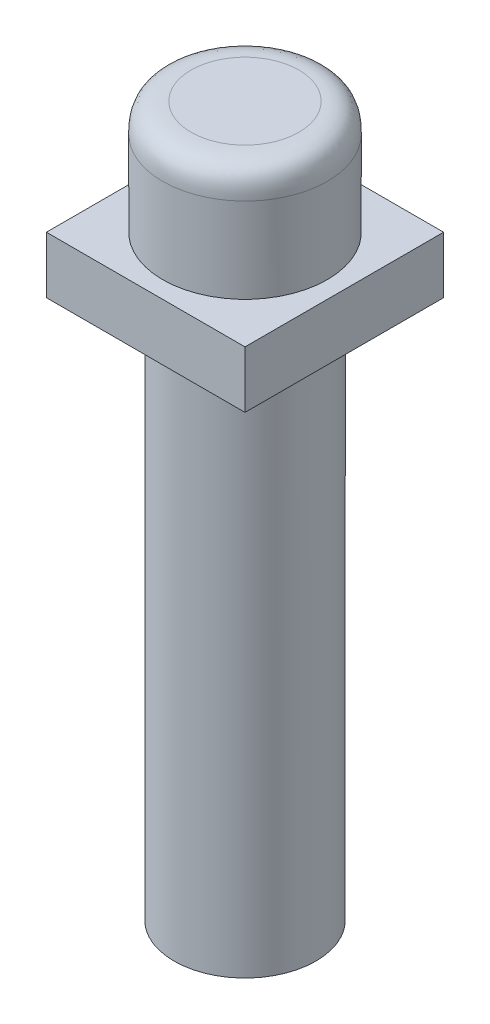
ISO-10303-21;
HEADER;
FILE_DESCRIPTION(('STEP AP214'),'2;1');
FILE_NAME('part.step','',(''),(''),'','','');
FILE_SCHEMA(('AUTOMOTIVE_DESIGN { 1 0 10303 214 1 1 1 1 }'));
ENDSEC;
DATA;
#1=APPLICATION_CONTEXT('core data for automotive mechanical design processes');
#2=APPLICATION_PROTOCOL_DEFINITION('international standard','automotive_design',2000,#1);
#3=PRODUCT_CONTEXT('',#1,'mechanical');
#4=PRODUCT('Part','Part','',(#3));
#5=PRODUCT_RELATED_PRODUCT_CATEGORY('part','',(#4));
#6=PRODUCT_DEFINITION_FORMATION('','',#4);
#7=PRODUCT_DEFINITION_CONTEXT('part definition',#1,'design');
#8=PRODUCT_DEFINITION('design','',#6,#7);
#9=PRODUCT_DEFINITION_SHAPE('','',#8);
#10=(LENGTH_UNIT() NAMED_UNIT(*) SI_UNIT(.MILLI.,.METRE.));
#11=(NAMED_UNIT(*) PLANE_ANGLE_UNIT() SI_UNIT($,.RADIAN.));
#12=(NAMED_UNIT(*) SI_UNIT($,.STERADIAN.) SOLID_ANGLE_UNIT());
#13=UNCERTAINTY_MEASURE_WITH_UNIT(LENGTH_MEASURE(1.E-05),#10,'distance_accuracy_value','');
#14=(GEOMETRIC_REPRESENTATION_CONTEXT(3) GLOBAL_UNCERTAINTY_ASSIGNED_CONTEXT((#13)) GLOBAL_UNIT_ASSIGNED_CONTEXT((#10,
#11,#12)) REPRESENTATION_CONTEXT('',''));
#15=CARTESIAN_POINT('',(0.,0.,0.));
#16=DIRECTION('',(0.,0.,1.));
#17=DIRECTION('',(1.,0.,0.));
#18=AXIS2_PLACEMENT_3D('',#15,#16,#17);
#19=CARTESIAN_POINT('',(3.5,2.,-3.5));
#20=DIRECTION('',(-1.,0.,0.));
#21=DIRECTION('',(0.,0.,1.));
#22=AXIS2_PLACEMENT_3D('',#19,#20,#21);
#23=PLANE('',#22);
#24=DIRECTION('',(0.,0.,-1.));
#25=VECTOR('',#24,1.);
#26=CARTESIAN_POINT('',(3.5,0.,-3.5));
#27=LINE('',#26,#25);
#28=CARTESIAN_POINT('',(3.5,0.,3.5));
#29=VERTEX_POINT('',#28);
#30=CARTESIAN_POINT('',(3.5,0.,-3.5));
#31=VERTEX_POINT('',#30);
#32=EDGE_CURVE('E114',#29,#31,#27,.T.);
#33=ORIENTED_EDGE('',*,*,#32,.T.);
#34=DIRECTION('',(0.,-1.,0.));
#35=VECTOR('',#34,1.);
#36=CARTESIAN_POINT('',(3.5,2.,-3.5));
#37=LINE('',#36,#35);
#38=CARTESIAN_POINT('',(3.5,2.,-3.5));
#39=VERTEX_POINT('',#38);
#40=EDGE_CURVE('E105',#39,#31,#37,.T.);
#41=ORIENTED_EDGE('',*,*,#40,.F.);
#42=DIRECTION('',(0.,0.,-1.));
#43=VECTOR('',#42,1.);
#44=CARTESIAN_POINT('',(3.5,2.,-3.5));
#45=LINE('',#44,#43);
#46=CARTESIAN_POINT('',(3.5,2.,3.5));
#47=VERTEX_POINT('',#46);
#48=EDGE_CURVE('E99',#47,#39,#45,.T.);
#49=ORIENTED_EDGE('',*,*,#48,.F.);
#50=DIRECTION('',(0.,-1.,0.));
#51=VECTOR('',#50,1.);
#52=CARTESIAN_POINT('',(3.5,2.,3.5));
#53=LINE('',#52,#51);
#54=EDGE_CURVE('E110',#47,#29,#53,.T.);
#55=ORIENTED_EDGE('',*,*,#54,.T.);
#56=EDGE_LOOP('',(#33,#41,#49,#55));
#57=FACE_BOUND('',#56,.T.);
#58=ADVANCED_FACE('F40',(#57),#23,.F.);
#59=CARTESIAN_POINT('',(-3.5,2.,-3.5));
#60=DIRECTION('',(0.,0.,1.));
#61=DIRECTION('',(1.,0.,0.));
#62=AXIS2_PLACEMENT_3D('',#59,#60,#61);
#63=PLANE('',#62);
#64=DIRECTION('',(-1.,0.,0.));
#65=VECTOR('',#64,1.);
#66=CARTESIAN_POINT('',(-3.5,0.,-3.5));
#67=LINE('',#66,#65);
#68=CARTESIAN_POINT('',(-3.5,0.,-3.5));
#69=VERTEX_POINT('',#68);
#70=EDGE_CURVE('E104',#31,#69,#67,.T.);
#71=ORIENTED_EDGE('',*,*,#70,.T.);
#72=DIRECTION('',(0.,-1.,0.));
#73=VECTOR('',#72,1.);
#74=CARTESIAN_POINT('',(-3.5,2.,-3.5));
#75=LINE('',#74,#73);
#76=CARTESIAN_POINT('',(-3.5,2.,-3.5));
#77=VERTEX_POINT('',#76);
#78=EDGE_CURVE('E102',#77,#69,#75,.T.);
#79=ORIENTED_EDGE('',*,*,#78,.F.);
#80=DIRECTION('',(-1.,0.,0.));
#81=VECTOR('',#80,1.);
#82=CARTESIAN_POINT('',(-3.5,2.,-3.5));
#83=LINE('',#82,#81);
#84=EDGE_CURVE('E94',#39,#77,#83,.T.);
#85=ORIENTED_EDGE('',*,*,#84,.F.);
#86=ORIENTED_EDGE('',*,*,#40,.T.);
#87=EDGE_LOOP('',(#71,#79,#85,#86));
#88=FACE_BOUND('',#87,.T.);
#89=ADVANCED_FACE('F103',(#88),#63,.F.);
#90=CARTESIAN_POINT('',(-3.5,2.,-3.5));
#91=DIRECTION('',(1.,0.,0.));
#92=DIRECTION('',(0.,0.,-1.));
#93=AXIS2_PLACEMENT_3D('',#90,#91,#92);
#94=PLANE('',#93);
#95=DIRECTION('',(0.,0.,1.));
#96=VECTOR('',#95,1.);
#97=CARTESIAN_POINT('',(-3.5,0.,-3.5));
#98=LINE('',#97,#96);
#99=CARTESIAN_POINT('',(-3.5,0.,3.5));
#100=VERTEX_POINT('',#99);
#101=EDGE_CURVE('E80',#69,#100,#98,.T.);
#102=ORIENTED_EDGE('',*,*,#101,.T.);
#103=DIRECTION('',(0.,-1.,0.));
#104=VECTOR('',#103,1.);
#105=CARTESIAN_POINT('',(-3.5,2.,3.5));
#106=LINE('',#105,#104);
#107=CARTESIAN_POINT('',(-3.5,2.,3.5));
#108=VERTEX_POINT('',#107);
#109=EDGE_CURVE('E106',#108,#100,#106,.T.);
#110=ORIENTED_EDGE('',*,*,#109,.F.);
#111=DIRECTION('',(0.,0.,1.));
#112=VECTOR('',#111,1.);
#113=CARTESIAN_POINT('',(-3.5,2.,-3.5));
#114=LINE('',#113,#112);
#115=EDGE_CURVE('E97',#77,#108,#114,.T.);
#116=ORIENTED_EDGE('',*,*,#115,.F.);
#117=ORIENTED_EDGE('',*,*,#78,.T.);
#118=EDGE_LOOP('',(#102,#110,#116,#117));
#119=FACE_BOUND('',#118,.T.);
#120=ADVANCED_FACE('F108',(#119),#94,.F.);
#121=CARTESIAN_POINT('',(-3.5,2.,3.5));
#122=DIRECTION('',(0.,0.,-1.));
#123=DIRECTION('',(-1.,0.,0.));
#124=AXIS2_PLACEMENT_3D('',#121,#122,#123);
#125=PLANE('',#124);
#126=DIRECTION('',(1.,0.,0.));
#127=VECTOR('',#126,1.);
#128=CARTESIAN_POINT('',(-3.5,0.,3.5));
#129=LINE('',#128,#127);
#130=EDGE_CURVE('E86',#100,#29,#129,.T.);
#131=ORIENTED_EDGE('',*,*,#130,.T.);
#132=ORIENTED_EDGE('',*,*,#54,.F.);
#133=DIRECTION('',(1.,0.,0.));
#134=VECTOR('',#133,1.);
#135=CARTESIAN_POINT('',(-3.5,2.,3.5));
#136=LINE('',#135,#134);
#137=EDGE_CURVE('E63',#108,#47,#136,.T.);
#138=ORIENTED_EDGE('',*,*,#137,.F.);
#139=ORIENTED_EDGE('',*,*,#109,.T.);
#140=EDGE_LOOP('',(#131,#132,#138,#139));
#141=FACE_BOUND('',#140,.T.);
#142=ADVANCED_FACE('F210',(#141),#125,.F.);
#143=CARTESIAN_POINT('',(0.,2.,0.));
#144=DIRECTION('',(0.,1.,0.));
#145=DIRECTION('',(0.,0.,1.));
#146=AXIS2_PLACEMENT_3D('',#143,#144,#145);
#147=PLANE('',#146);
#148=CARTESIAN_POINT('',(0.,2.,0.));
#149=DIRECTION('',(0.,1.,0.));
#150=DIRECTION('',(0.,0.,1.));
#151=AXIS2_PLACEMENT_3D('',#148,#149,#150);
#152=CIRCLE('',#151,2.9);
#153=CARTESIAN_POINT('',(0.,2.,2.9));
#154=VERTEX_POINT('',#153);
#155=EDGE_CURVE('E124',#154,#154,#152,.T.);
#156=ORIENTED_EDGE('',*,*,#155,.F.);
#157=EDGE_LOOP('',(#156));
#158=FACE_BOUND('',#157,.T.);
#159=ORIENTED_EDGE('',*,*,#48,.T.);
#160=ORIENTED_EDGE('',*,*,#84,.T.);
#161=ORIENTED_EDGE('',*,*,#115,.T.);
#162=ORIENTED_EDGE('',*,*,#137,.T.);
#163=EDGE_LOOP('',(#159,#160,#161,#162));
#164=FACE_BOUND('',#163,.T.);
#165=ADVANCED_FACE('F95',(#158,#164),#147,.T.);
#166=CARTESIAN_POINT('',(0.,0.,0.));
#167=DIRECTION('',(0.,1.,0.));
#168=DIRECTION('',(0.,0.,1.));
#169=AXIS2_PLACEMENT_3D('',#166,#167,#168);
#170=PLANE('',#169);
#171=CARTESIAN_POINT('',(0.,0.,0.));
#172=DIRECTION('',(0.,1.,0.));
#173=DIRECTION('',(0.,0.,1.));
#174=AXIS2_PLACEMENT_3D('',#171,#172,#173);
#175=CIRCLE('',#174,2.5);
#176=CARTESIAN_POINT('',(0.,0.,2.5));
#177=VERTEX_POINT('',#176);
#178=EDGE_CURVE('E125',#177,#177,#175,.F.);
#179=ORIENTED_EDGE('',*,*,#178,.F.);
#180=EDGE_LOOP('',(#179));
#181=FACE_BOUND('',#180,.T.);
#182=ORIENTED_EDGE('',*,*,#32,.F.);
#183=ORIENTED_EDGE('',*,*,#130,.F.);
#184=ORIENTED_EDGE('',*,*,#101,.F.);
#185=ORIENTED_EDGE('',*,*,#70,.F.);
#186=EDGE_LOOP('',(#182,#183,#184,#185));
#187=FACE_BOUND('',#186,.T.);
#188=ADVANCED_FACE('F154',(#181,#187),#170,.F.);
#189=CARTESIAN_POINT('',(0.,6.,0.));
#190=DIRECTION('',(0.,-1.,0.));
#191=DIRECTION('',(0.,0.,-1.));
#192=AXIS2_PLACEMENT_3D('',#189,#190,#191);
#193=CYLINDRICAL_SURFACE('',#192,2.9);
#194=CARTESIAN_POINT('',(0.,5.,2.9));
#195=CARTESIAN_POINT('',(0.379558029501162,5.,2.9));
#196=CARTESIAN_POINT('',(1.13867408850348,5.00000000000001,2.74900242758793));
#197=CARTESIAN_POINT('',(2.10399536913863,5.,2.10399536913863));
#198=CARTESIAN_POINT('',(2.74900242758793,5.,1.13867408850348));
#199=CARTESIAN_POINT('',(2.97549878620603,5.,0.));
#200=CARTESIAN_POINT('',(2.74900242758793,5.00000000000001,-1.13867408850348));
#201=CARTESIAN_POINT('',(2.10399536913862,5.,-2.10399536913863));
#202=CARTESIAN_POINT('',(1.13867408850349,5.00000000000001,-2.74900242758793));
#203=CARTESIAN_POINT('',(0.,5.,-2.97549878620603));
#204=CARTESIAN_POINT('',(-1.13867408850347,5.00000000000001,-2.74900242758794));
#205=CARTESIAN_POINT('',(-2.10399536913863,5.,-2.10399536913862));
#206=CARTESIAN_POINT('',(-2.74900242758793,5.,-1.13867408850349));
#207=CARTESIAN_POINT('',(-2.97549878620604,5.00000000000001,0.));
#208=CARTESIAN_POINT('',(-2.74900242758793,5.00000000000001,1.13867408850347));
#209=CARTESIAN_POINT('',(-2.10399536913864,5.00000000000001,2.10399536913862));
#210=CARTESIAN_POINT('',(-1.13867408850349,5.00000000000001,2.74900242758793));
#211=CARTESIAN_POINT('',(-0.379558029501162,5.,2.9));
#212=CARTESIAN_POINT('',(0.,5.,2.9));
#213=B_SPLINE_CURVE_WITH_KNOTS('',3,(#194,#195,#196,#197,#198,#199,#200,#201,#202,#203,#204,
#205,#206,#207,#208,#209,#210,#211,#212),.UNSPECIFIED.,.T.,.F.,(4,1,1,1,1,1,1,1,1,1,1,1,1,1,1,1,
4),(0.,0.392699081698724,0.785398163397448,1.17809724509617,1.5707963267949,1.96349540849362,
2.35619449019234,2.74889357189107,3.14159265358979,3.53429173528852,3.92699081698724,
4.31968989868597,4.71238898038469,5.10508806208341,5.49778714378214,5.89048622548086,
6.28318530717959),.UNSPECIFIED.);
#214=CARTESIAN_POINT('',(0.,5.00000000000001,2.9));
#215=VERTEX_POINT('',#214);
#216=EDGE_CURVE('E12',#215,#215,#213,.F.);
#217=ORIENTED_EDGE('',*,*,#216,.T.);
#218=EDGE_LOOP('',(#217));
#219=FACE_BOUND('',#218,.T.);
#220=ORIENTED_EDGE('',*,*,#155,.T.);
#221=EDGE_LOOP('',(#220));
#222=FACE_BOUND('',#221,.T.);
#223=ADVANCED_FACE('F148',(#219,#222),#193,.T.);
#224=CARTESIAN_POINT('',(0.,6.,0.));
#225=DIRECTION('',(0.,1.,0.));
#226=DIRECTION('',(0.,0.,1.));
#227=AXIS2_PLACEMENT_3D('',#224,#225,#226);
#228=PLANE('',#227);
#229=CARTESIAN_POINT('',(0.,6.,1.9));
#230=CARTESIAN_POINT('',(-0.24867595036283,6.,1.9));
#231=CARTESIAN_POINT('',(-0.746027851088491,6.,1.80107055600589));
#232=CARTESIAN_POINT('',(-1.37847972460807,6.,1.37847972460806));
#233=CARTESIAN_POINT('',(-1.80107055600589,6.,0.746027851088483));
#234=CARTESIAN_POINT('',(-1.94946472199706,6.,0.));
#235=CARTESIAN_POINT('',(-1.80107055600588,6.,-0.746027851088495));
#236=CARTESIAN_POINT('',(-1.37847972460807,6.,-1.37847972460806));
#237=CARTESIAN_POINT('',(-0.746027851088484,6.,-1.80107055600589));
#238=CARTESIAN_POINT('',(0.,6.,-1.94946472199706));
#239=CARTESIAN_POINT('',(0.746027851088495,6.,-1.80107055600588));
#240=CARTESIAN_POINT('',(1.37847972460806,6.,-1.37847972460807));
#241=CARTESIAN_POINT('',(1.80107055600589,6.,-0.74602785108849));
#242=CARTESIAN_POINT('',(1.94946472199706,6.,0.));
#243=CARTESIAN_POINT('',(1.80107055600589,6.,0.746027851088488));
#244=CARTESIAN_POINT('',(1.37847972460807,6.,1.37847972460807));
#245=CARTESIAN_POINT('',(0.746027851088489,6.,1.80107055600589));
#246=CARTESIAN_POINT('',(0.24867595036283,6.,1.9));
#247=CARTESIAN_POINT('',(0.,6.,1.9));
#248=B_SPLINE_CURVE_WITH_KNOTS('',3,(#229,#230,#231,#232,#233,#234,#235,#236,#237,#238,#239,
#240,#241,#242,#243,#244,#245,#246,#247),.UNSPECIFIED.,.T.,.F.,(4,1,1,1,1,1,1,1,1,1,1,1,1,1,1,1,
4),(0.,0.392699081698724,0.785398163397448,1.17809724509617,1.5707963267949,1.96349540849362,
2.35619449019235,2.74889357189107,3.14159265358979,3.53429173528852,3.92699081698724,
4.31968989868597,4.71238898038469,5.10508806208341,5.49778714378214,5.89048622548086,
6.28318530717959),.UNSPECIFIED.);
#249=CARTESIAN_POINT('',(0.,6.,1.9));
#250=VERTEX_POINT('',#249);
#251=EDGE_CURVE('E55',#250,#250,#248,.F.);
#252=ORIENTED_EDGE('',*,*,#251,.T.);
#253=EDGE_LOOP('',(#252));
#254=FACE_BOUND('',#253,.T.);
#255=ADVANCED_FACE('F137',(#254),#228,.T.);
#256=CARTESIAN_POINT('',(0.,-19.,0.));
#257=DIRECTION('',(0.,-1.,0.));
#258=DIRECTION('',(0.,0.,-1.));
#259=AXIS2_PLACEMENT_3D('',#256,#257,#258);
#260=PLANE('',#259);
#261=CARTESIAN_POINT('',(0.,-19.,0.));
#262=DIRECTION('',(0.,-1.,0.));
#263=DIRECTION('',(0.,0.,-1.));
#264=AXIS2_PLACEMENT_3D('',#261,#262,#263);
#265=CIRCLE('',#264,2.5);
#266=CARTESIAN_POINT('',(0.,-19.,-2.5));
#267=VERTEX_POINT('',#266);
#268=EDGE_CURVE('E117',#267,#267,#265,.T.);
#269=ORIENTED_EDGE('',*,*,#268,.T.);
#270=EDGE_LOOP('',(#269));
#271=FACE_BOUND('',#270,.T.);
#272=CARTESIAN_POINT('',(0.,-19.,0.));
#273=DIRECTION('',(0.,-1.,0.));
#274=DIRECTION('',(0.,0.,-1.));
#275=AXIS2_PLACEMENT_3D('',#272,#273,#274);
#276=CIRCLE('',#275,1.25);
#277=CARTESIAN_POINT('',(0.,-19.,-1.25));
#278=VERTEX_POINT('',#277);
#279=EDGE_CURVE('E184',#278,#278,#276,.T.);
#280=ORIENTED_EDGE('',*,*,#279,.F.);
#281=EDGE_LOOP('',(#280));
#282=FACE_BOUND('',#281,.T.);
#283=ADVANCED_FACE('F147',(#271,#282),#260,.T.);
#284=CARTESIAN_POINT('',(0.,-19.,0.));
#285=DIRECTION('',(0.,1.,0.));
#286=DIRECTION('',(0.,0.,1.));
#287=AXIS2_PLACEMENT_3D('',#284,#285,#286);
#288=CYLINDRICAL_SURFACE('',#287,2.5);
#289=ORIENTED_EDGE('',*,*,#268,.F.);
#290=EDGE_LOOP('',(#289));
#291=FACE_BOUND('',#290,.T.);
#292=ORIENTED_EDGE('',*,*,#178,.T.);
#293=EDGE_LOOP('',(#292));
#294=FACE_BOUND('',#293,.T.);
#295=ADVANCED_FACE('F149',(#291,#294),#288,.T.);
#296=CARTESIAN_POINT('',(0.,-19.,0.));
#297=DIRECTION('',(0.,1.,0.));
#298=DIRECTION('',(0.,0.,1.));
#299=AXIS2_PLACEMENT_3D('',#296,#297,#298);
#300=CYLINDRICAL_SURFACE('',#299,1.25);
#301=ORIENTED_EDGE('',*,*,#279,.T.);
#302=EDGE_LOOP('',(#301));
#303=FACE_BOUND('',#302,.T.);
#304=CARTESIAN_POINT('',(0.,0.,0.));
#305=DIRECTION('',(0.,-1.,0.));
#306=DIRECTION('',(0.,0.,-1.));
#307=AXIS2_PLACEMENT_3D('',#304,#305,#306);
#308=CIRCLE('',#307,1.25);
#309=CARTESIAN_POINT('',(0.,0.,-1.25));
#310=VERTEX_POINT('',#309);
#311=EDGE_CURVE('E185',#310,#310,#308,.T.);
#312=ORIENTED_EDGE('',*,*,#311,.F.);
#313=EDGE_LOOP('',(#312));
#314=FACE_BOUND('',#313,.T.);
#315=ADVANCED_FACE('F191',(#303,#314),#300,.F.);
#316=ORIENTED_EDGE('',*,*,#311,.T.);
#317=EDGE_LOOP('',(#316));
#318=FACE_BOUND('',#317,.T.);
#319=ADVANCED_FACE('F214',(#318),#170,.F.);
#320=CARTESIAN_POINT('',(0.,6.,1.9));
#321=CARTESIAN_POINT('',(0.24867595036283,6.,1.9));
#322=CARTESIAN_POINT('',(0.746027851088489,6.,1.80107055600589));
#323=CARTESIAN_POINT('',(1.37847972460807,6.,1.37847972460807));
#324=CARTESIAN_POINT('',(1.80107055600589,6.,0.746027851088488));
#325=CARTESIAN_POINT('',(1.94946472199706,6.,0.));
#326=CARTESIAN_POINT('',(1.80107055600589,6.,-0.74602785108849));
#327=CARTESIAN_POINT('',(1.37847972460806,6.,-1.37847972460807));
#328=CARTESIAN_POINT('',(0.746027851088495,6.,-1.80107055600588));
#329=CARTESIAN_POINT('',(0.,6.,-1.94946472199706));
#330=CARTESIAN_POINT('',(-0.746027851088484,6.,-1.80107055600589));
#331=CARTESIAN_POINT('',(-1.37847972460807,6.,-1.37847972460806));
#332=CARTESIAN_POINT('',(-1.80107055600588,6.,-0.746027851088495));
#333=CARTESIAN_POINT('',(-1.94946472199706,6.,0.));
#334=CARTESIAN_POINT('',(-1.80107055600589,6.,0.746027851088483));
#335=CARTESIAN_POINT('',(-1.37847972460807,6.,1.37847972460806));
#336=CARTESIAN_POINT('',(-0.746027851088491,6.,1.80107055600589));
#337=CARTESIAN_POINT('',(-0.24867595036283,6.,1.9));
#338=CARTESIAN_POINT('',(0.,6.,1.9));
#339=CARTESIAN_POINT('',(0.,6.,2.06819805153395));
#340=CARTESIAN_POINT('',(0.270690061054609,6.,2.06819805153395));
#341=CARTESIAN_POINT('',(0.812070183163827,6.,1.96051084979291));
#342=CARTESIAN_POINT('',(1.5005100423755,6.,1.5005100423755));
#343=CARTESIAN_POINT('',(1.96051084979291,6.,0.812070183163825));
#344=CARTESIAN_POINT('',(2.12204165240446,6.,0.));
#345=CARTESIAN_POINT('',(1.96051084979291,6.,-0.812070183163827));
#346=CARTESIAN_POINT('',(1.5005100423755,6.,-1.5005100423755));
#347=CARTESIAN_POINT('',(0.812070183163833,6.,-1.96051084979291));
#348=CARTESIAN_POINT('',(0.,6.,-2.12204165240446));
#349=CARTESIAN_POINT('',(-0.812070183163821,6.,-1.96051084979292));
#350=CARTESIAN_POINT('',(-1.50051004237551,6.,-1.5005100423755));
#351=CARTESIAN_POINT('',(-1.96051084979291,6.,-0.812070183163833));
#352=CARTESIAN_POINT('',(-2.12204165240446,6.,0.));
#353=CARTESIAN_POINT('',(-1.96051084979291,6.,0.81207018316382));
#354=CARTESIAN_POINT('',(-1.50051004237551,6.,1.5005100423755));
#355=CARTESIAN_POINT('',(-0.812070183163828,6.,1.96051084979291));
#356=CARTESIAN_POINT('',(-0.270690061054609,6.,2.06819805153395));
#357=CARTESIAN_POINT('',(0.,6.,2.06819805153395));
#358=CARTESIAN_POINT('',(0.,6.,2.23639610306789));
#359=CARTESIAN_POINT('',(0.292704171746388,6.,2.23639610306789));
#360=CARTESIAN_POINT('',(0.878112515239164,6.,2.11995114357994));
#361=CARTESIAN_POINT('',(1.62254036014294,6.,1.62254036014294));
#362=CARTESIAN_POINT('',(2.11995114357994,6.,0.878112515239162));
#363=CARTESIAN_POINT('',(2.29461858281187,6.,0.));
#364=CARTESIAN_POINT('',(2.11995114357994,6.,-0.878112515239164));
#365=CARTESIAN_POINT('',(1.62254036014293,6.,-1.62254036014294));
#366=CARTESIAN_POINT('',(0.878112515239171,6.,-2.11995114357994));
#367=CARTESIAN_POINT('',(0.,6.,-2.29461858281187));
#368=CARTESIAN_POINT('',(-0.878112515239157,6.,-2.11995114357994));
#369=CARTESIAN_POINT('',(-1.62254036014294,6.,-1.62254036014293));
#370=CARTESIAN_POINT('',(-2.11995114357994,6.,-0.87811251523917));
#371=CARTESIAN_POINT('',(-2.29461858281187,6.,0.));
#372=CARTESIAN_POINT('',(-2.11995114357994,6.,0.878112515239157));
#373=CARTESIAN_POINT('',(-1.62254036014294,6.,1.62254036014293));
#374=CARTESIAN_POINT('',(-0.878112515239166,6.,2.11995114357994));
#375=CARTESIAN_POINT('',(-0.292704171746388,6.,2.23639610306789));
#376=CARTESIAN_POINT('',(0.,6.,2.23639610306789));
#377=CARTESIAN_POINT('',(0.,5.92830808016392,2.60710678118655));
#378=CARTESIAN_POINT('',(0.341223556057339,5.92830808016392,2.60710678118655));
#379=CARTESIAN_POINT('',(1.02367066817201,5.92830808016392,2.47135961050441));
#380=CARTESIAN_POINT('',(1.89149675671256,5.92830808016392,1.89149675671256));
#381=CARTESIAN_POINT('',(2.47135961050441,5.92830808016392,1.02367066817201));
#382=CARTESIAN_POINT('',(2.67498036652762,5.92830808016392,0.));
#383=CARTESIAN_POINT('',(2.47135961050441,5.92830808016392,-1.02367066817202));
#384=CARTESIAN_POINT('',(1.89149675671255,5.92830808016391,-1.89149675671256));
#385=CARTESIAN_POINT('',(1.02367066817202,5.92830808016392,-2.47135961050441));
#386=CARTESIAN_POINT('',(0.,5.92830808016391,-2.67498036652762));
#387=CARTESIAN_POINT('',(-1.02367066817201,5.92830808016392,-2.47135961050441));
#388=CARTESIAN_POINT('',(-1.89149675671256,5.92830808016392,-1.89149675671255));
#389=CARTESIAN_POINT('',(-2.4713596105044,5.92830808016392,-1.02367066817202));
#390=CARTESIAN_POINT('',(-2.67498036652762,5.92830808016392,0.));
#391=CARTESIAN_POINT('',(-2.47135961050441,5.92830808016392,1.02367066817201));
#392=CARTESIAN_POINT('',(-1.89149675671256,5.92830808016392,1.89149675671255));
#393=CARTESIAN_POINT('',(-1.02367066817202,5.92830808016391,2.47135961050441));
#394=CARTESIAN_POINT('',(-0.341223556057339,5.92830808016392,2.60710678118655));
#395=CARTESIAN_POINT('',(0.,5.92830808016392,2.60710678118655));
#396=CARTESIAN_POINT('',(0.,5.70710678118655,2.82830808016392));
#397=CARTESIAN_POINT('',(0.370174841975597,5.70710678118655,2.82830808016392));
#398=CARTESIAN_POINT('',(1.11052452592679,5.70710678118655,2.6810433718404));
#399=CARTESIAN_POINT('',(2.05198175971112,5.70710678118655,2.05198175971112));
#400=CARTESIAN_POINT('',(2.6810433718404,5.70710678118655,1.11052452592679));
#401=CARTESIAN_POINT('',(2.90194043432567,5.70710678118655,0.));
#402=CARTESIAN_POINT('',(2.68104337184041,5.70710678118655,-1.11052452592679));
#403=CARTESIAN_POINT('',(2.05198175971111,5.70710678118655,-2.05198175971112));
#404=CARTESIAN_POINT('',(1.1105245259268,5.70710678118655,-2.6810433718404));
#405=CARTESIAN_POINT('',(0.,5.70710678118654,-2.90194043432567));
#406=CARTESIAN_POINT('',(-1.11052452592678,5.70710678118655,-2.68104337184041));
#407=CARTESIAN_POINT('',(-2.05198175971112,5.70710678118655,-2.05198175971111));
#408=CARTESIAN_POINT('',(-2.6810433718404,5.70710678118655,-1.1105245259268));
#409=CARTESIAN_POINT('',(-2.90194043432567,5.70710678118655,0.));
#410=CARTESIAN_POINT('',(-2.6810433718404,5.70710678118655,1.11052452592678));
#411=CARTESIAN_POINT('',(-2.05198175971113,5.70710678118655,2.05198175971111));
#412=CARTESIAN_POINT('',(-1.11052452592679,5.70710678118655,2.6810433718404));
#413=CARTESIAN_POINT('',(-0.370174841975596,5.70710678118655,2.82830808016392));
#414=CARTESIAN_POINT('',(0.,5.70710678118655,2.82830808016392));
#415=CARTESIAN_POINT('',(0.,5.33639610306789,2.9));
#416=CARTESIAN_POINT('',(0.379558029501162,5.33639610306789,2.9));
#417=CARTESIAN_POINT('',(1.13867408850348,5.33639610306789,2.74900242758793));
#418=CARTESIAN_POINT('',(2.10399536913863,5.33639610306789,2.10399536913863));
#419=CARTESIAN_POINT('',(2.74900242758793,5.33639610306789,1.13867408850348));
#420=CARTESIAN_POINT('',(2.97549878620603,5.33639610306789,0.));
#421=CARTESIAN_POINT('',(2.74900242758793,5.3363961030679,-1.13867408850348));
#422=CARTESIAN_POINT('',(2.10399536913862,5.33639610306789,-2.10399536913863));
#423=CARTESIAN_POINT('',(1.13867408850349,5.3363961030679,-2.74900242758793));
#424=CARTESIAN_POINT('',(0.,5.33639610306789,-2.97549878620603));
#425=CARTESIAN_POINT('',(-1.13867408850347,5.3363961030679,-2.74900242758794));
#426=CARTESIAN_POINT('',(-2.10399536913863,5.33639610306789,-2.10399536913862));
#427=CARTESIAN_POINT('',(-2.74900242758793,5.33639610306789,-1.13867408850349));
#428=CARTESIAN_POINT('',(-2.97549878620604,5.3363961030679,0.));
#429=CARTESIAN_POINT('',(-2.74900242758793,5.33639610306789,1.13867408850347));
#430=CARTESIAN_POINT('',(-2.10399536913864,5.3363961030679,2.10399536913862));
#431=CARTESIAN_POINT('',(-1.13867408850349,5.33639610306789,2.74900242758793));
#432=CARTESIAN_POINT('',(-0.379558029501162,5.33639610306789,2.9));
#433=CARTESIAN_POINT('',(0.,5.33639610306789,2.9));
#434=CARTESIAN_POINT('',(0.,5.16819805153395,2.9));
#435=CARTESIAN_POINT('',(0.379558029501162,5.16819805153395,2.9));
#436=CARTESIAN_POINT('',(1.13867408850348,5.16819805153395,2.74900242758793));
#437=CARTESIAN_POINT('',(2.10399536913863,5.16819805153395,2.10399536913863));
#438=CARTESIAN_POINT('',(2.74900242758793,5.16819805153395,1.13867408850348));
#439=CARTESIAN_POINT('',(2.97549878620603,5.16819805153395,0.));
#440=CARTESIAN_POINT('',(2.74900242758793,5.16819805153395,-1.13867408850348));
#441=CARTESIAN_POINT('',(2.10399536913862,5.16819805153395,-2.10399536913863));
#442=CARTESIAN_POINT('',(1.13867408850349,5.16819805153395,-2.74900242758793));
#443=CARTESIAN_POINT('',(0.,5.16819805153395,-2.97549878620603));
#444=CARTESIAN_POINT('',(-1.13867408850347,5.16819805153395,-2.74900242758794));
#445=CARTESIAN_POINT('',(-2.10399536913863,5.16819805153395,-2.10399536913862));
#446=CARTESIAN_POINT('',(-2.74900242758793,5.16819805153395,-1.13867408850349));
#447=CARTESIAN_POINT('',(-2.97549878620604,5.16819805153395,0.));
#448=CARTESIAN_POINT('',(-2.74900242758793,5.16819805153395,1.13867408850347));
#449=CARTESIAN_POINT('',(-2.10399536913864,5.16819805153395,2.10399536913862));
#450=CARTESIAN_POINT('',(-1.13867408850349,5.16819805153395,2.74900242758793));
#451=CARTESIAN_POINT('',(-0.379558029501162,5.16819805153395,2.9));
#452=CARTESIAN_POINT('',(0.,5.16819805153395,2.9));
#453=CARTESIAN_POINT('',(0.,5.,2.9));
#454=CARTESIAN_POINT('',(0.379558029501162,5.,2.9));
#455=CARTESIAN_POINT('',(1.13867408850348,5.,2.74900242758793));
#456=CARTESIAN_POINT('',(2.10399536913863,5.,2.10399536913863));
#457=CARTESIAN_POINT('',(2.74900242758793,5.,1.13867408850348));
#458=CARTESIAN_POINT('',(2.97549878620603,5.,0.));
#459=CARTESIAN_POINT('',(2.74900242758793,5.,-1.13867408850348));
#460=CARTESIAN_POINT('',(2.10399536913862,5.,-2.10399536913863));
#461=CARTESIAN_POINT('',(1.13867408850349,5.,-2.74900242758793));
#462=CARTESIAN_POINT('',(0.,5.,-2.97549878620603));
#463=CARTESIAN_POINT('',(-1.13867408850347,5.,-2.74900242758794));
#464=CARTESIAN_POINT('',(-2.10399536913863,5.,-2.10399536913862));
#465=CARTESIAN_POINT('',(-2.74900242758793,5.,-1.13867408850349));
#466=CARTESIAN_POINT('',(-2.97549878620604,5.,0.));
#467=CARTESIAN_POINT('',(-2.74900242758793,5.,1.13867408850347));
#468=CARTESIAN_POINT('',(-2.10399536913864,5.,2.10399536913862));
#469=CARTESIAN_POINT('',(-1.13867408850349,5.,2.74900242758793));
#470=CARTESIAN_POINT('',(-0.379558029501162,5.,2.9));
#471=CARTESIAN_POINT('',(0.,5.,2.9));
#472=B_SPLINE_SURFACE_WITH_KNOTS('',5,3,((#320,#321,#322,#323,#324,#325,#326,#327,#328,#329,
#330,#331,#332,#333,#334,#335,#336,#337,#338),(#339,#340,#341,#342,#343,#344,#345,#346,#347,
#348,#349,#350,#351,#352,#353,#354,#355,#356,#357),(#358,#359,#360,#361,#362,#363,#364,#365,
#366,#367,#368,#369,#370,#371,#372,#373,#374,#375,#376),(#377,#378,#379,#380,#381,#382,#383,
#384,#385,#386,#387,#388,#389,#390,#391,#392,#393,#394,#395),(#396,#397,#398,#399,#400,#401,
#402,#403,#404,#405,#406,#407,#408,#409,#410,#411,#412,#413,#414),(#415,#416,#417,#418,#419,
#420,#421,#422,#423,#424,#425,#426,#427,#428,#429,#430,#431,#432,#433),(#434,#435,#436,#437,
#438,#439,#440,#441,#442,#443,#444,#445,#446,#447,#448,#449,#450,#451,#452),(#453,#454,#455,
#456,#457,#458,#459,#460,#461,#462,#463,#464,#465,#466,#467,#468,#469,#470,#471)),.UNSPECIFIED.,
.F.,.T.,.F.,(6,2,6),(4,1,1,1,1,1,1,1,1,1,1,1,1,1,1,1,4),(0.,0.5,1.),(0.,0.392699081698724,
0.785398163397448,1.17809724509617,1.5707963267949,1.96349540849362,2.35619449019234,
2.74889357189107,3.14159265358979,3.53429173528852,3.92699081698724,4.31968989868597,
4.71238898038469,5.10508806208341,5.49778714378214,5.89048622548086,6.28318530717959),.UNSPECIFIED.);
#473=ORIENTED_EDGE('',*,*,#216,.F.);
#474=EDGE_LOOP('',(#473));
#475=FACE_BOUND('',#474,.T.);
#476=ORIENTED_EDGE('',*,*,#251,.F.);
#477=EDGE_LOOP('',(#476));
#478=FACE_BOUND('',#477,.T.);
#479=ADVANCED_FACE('F43',(#475,#478),#472,.T.);
#480=CLOSED_SHELL('',(#58,#89,#120,#142,#165,#188,#223,#255,#283,#295,#315,#319,#479));
#481=MANIFOLD_SOLID_BREP('B2',#480);
#482=ADVANCED_BREP_SHAPE_REPRESENTATION('',(#18,#481),#14);
#483=SHAPE_DEFINITION_REPRESENTATION(#9,#482);
ENDSEC;
END-ISO-10303-21;
